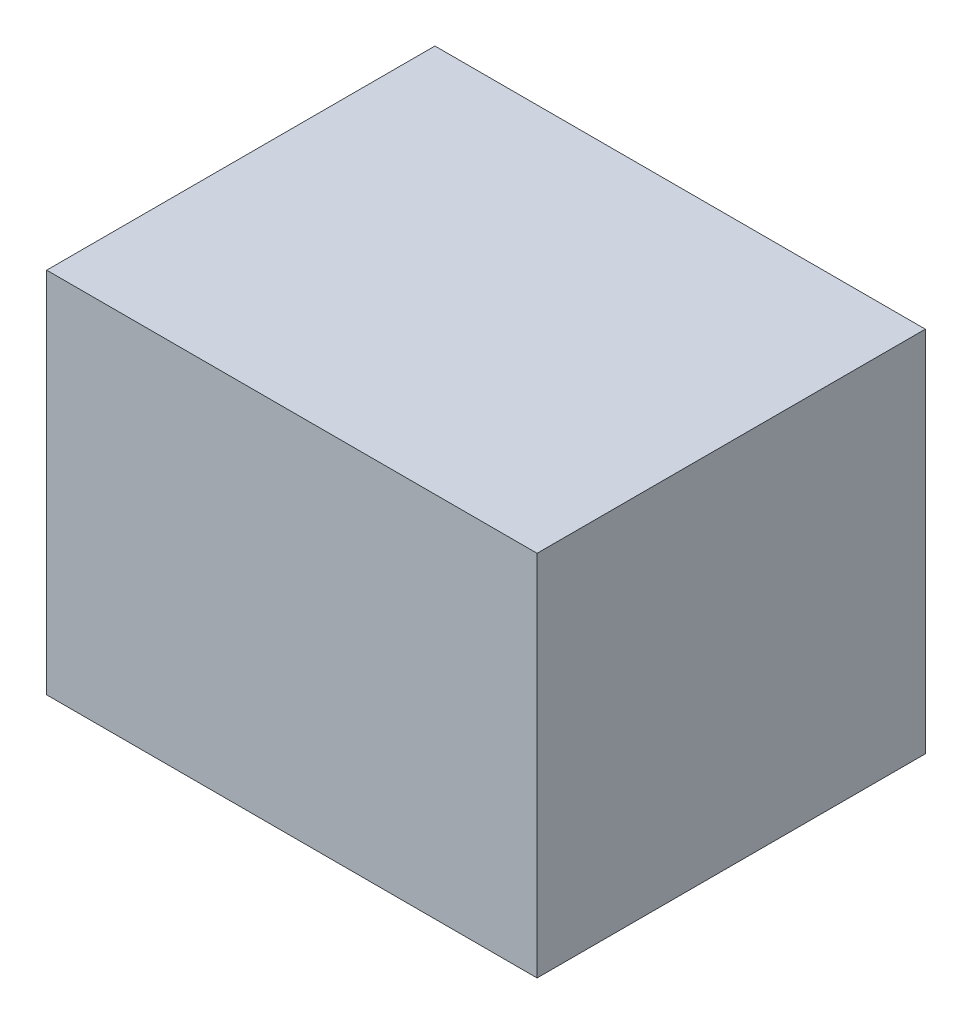
ISO-10303-21;
HEADER;
FILE_DESCRIPTION(('STEP AP214'),'2;1');
FILE_NAME('part.step','',(''),(''),'','','');
FILE_SCHEMA(('AUTOMOTIVE_DESIGN { 1 0 10303 214 1 1 1 1 }'));
ENDSEC;
DATA;
#1=APPLICATION_CONTEXT('core data for automotive mechanical design processes');
#2=APPLICATION_PROTOCOL_DEFINITION('international standard','automotive_design',2000,#1);
#3=PRODUCT_CONTEXT('',#1,'mechanical');
#4=PRODUCT('Part','Part','',(#3));
#5=PRODUCT_RELATED_PRODUCT_CATEGORY('part','',(#4));
#6=PRODUCT_DEFINITION_FORMATION('','',#4);
#7=PRODUCT_DEFINITION_CONTEXT('part definition',#1,'design');
#8=PRODUCT_DEFINITION('design','',#6,#7);
#9=PRODUCT_DEFINITION_SHAPE('','',#8);
#10=(LENGTH_UNIT() NAMED_UNIT(*) SI_UNIT(.MILLI.,.METRE.));
#11=(NAMED_UNIT(*) PLANE_ANGLE_UNIT() SI_UNIT($,.RADIAN.));
#12=(NAMED_UNIT(*) SI_UNIT($,.STERADIAN.) SOLID_ANGLE_UNIT());
#13=UNCERTAINTY_MEASURE_WITH_UNIT(LENGTH_MEASURE(1.E-05),#10,'distance_accuracy_value','');
#14=(GEOMETRIC_REPRESENTATION_CONTEXT(3) GLOBAL_UNCERTAINTY_ASSIGNED_CONTEXT((#13)) GLOBAL_UNIT_ASSIGNED_CONTEXT((#10,
#11,#12)) REPRESENTATION_CONTEXT('',''));
#15=CARTESIAN_POINT('',(0.,0.,0.));
#16=DIRECTION('',(0.,0.,1.));
#17=DIRECTION('',(1.,0.,0.));
#18=AXIS2_PLACEMENT_3D('',#15,#16,#17);
#19=CARTESIAN_POINT('',(-1.20000014,0.90000074,0.));
#20=DIRECTION('',(1.,0.,0.));
#21=DIRECTION('',(0.,-1.,0.));
#22=AXIS2_PLACEMENT_3D('',#19,#20,#21);
#23=PLANE('',#22);
#24=DIRECTION('',(0.,-1.,0.));
#25=VECTOR('',#24,1.);
#26=CARTESIAN_POINT('',(-1.20000014,0.90000074,0.));
#27=LINE('',#26,#25);
#28=CARTESIAN_POINT('',(-1.20000014,0.90000074,0.));
#29=VERTEX_POINT('',#28);
#30=CARTESIAN_POINT('',(-1.20000014,-0.8999982,0.));
#31=VERTEX_POINT('',#30);
#32=EDGE_CURVE('E11',#29,#31,#27,.T.);
#33=ORIENTED_EDGE('',*,*,#32,.T.);
#34=DIRECTION('',(0.,0.,1.));
#35=VECTOR('',#34,1.);
#36=CARTESIAN_POINT('',(-1.20000014,-0.8999982,0.));
#37=LINE('',#36,#35);
#38=CARTESIAN_POINT('',(-1.20000014,-0.8999982,1.89999874));
#39=VERTEX_POINT('',#38);
#40=EDGE_CURVE('E24',#31,#39,#37,.T.);
#41=ORIENTED_EDGE('',*,*,#40,.T.);
#42=DIRECTION('',(0.,-1.,0.));
#43=VECTOR('',#42,1.);
#44=CARTESIAN_POINT('',(-1.20000014,0.90000074,1.89999874));
#45=LINE('',#44,#43);
#46=CARTESIAN_POINT('',(-1.20000014,0.90000074,1.89999874));
#47=VERTEX_POINT('',#46);
#48=EDGE_CURVE('E87',#47,#39,#45,.T.);
#49=ORIENTED_EDGE('',*,*,#48,.F.);
#50=DIRECTION('',(0.,0.,1.));
#51=VECTOR('',#50,1.);
#52=CARTESIAN_POINT('',(-1.20000014,0.90000074,0.));
#53=LINE('',#52,#51);
#54=EDGE_CURVE('E36',#29,#47,#53,.T.);
#55=ORIENTED_EDGE('',*,*,#54,.F.);
#56=EDGE_LOOP('',(#33,#41,#49,#55));
#57=FACE_BOUND('',#56,.T.);
#58=ADVANCED_FACE('F17',(#57),#23,.F.);
#59=CARTESIAN_POINT('',(-1.20000014,-0.8999982,0.));
#60=DIRECTION('',(0.,1.,0.));
#61=DIRECTION('',(1.,0.,0.));
#62=AXIS2_PLACEMENT_3D('',#59,#60,#61);
#63=PLANE('',#62);
#64=DIRECTION('',(1.,0.,0.));
#65=VECTOR('',#64,1.);
#66=CARTESIAN_POINT('',(-1.20000014,-0.8999982,0.));
#67=LINE('',#66,#65);
#68=CARTESIAN_POINT('',(1.20000014,-0.8999982,0.));
#69=VERTEX_POINT('',#68);
#70=EDGE_CURVE('E84',#31,#69,#67,.T.);
#71=ORIENTED_EDGE('',*,*,#70,.T.);
#72=DIRECTION('',(0.,0.,1.));
#73=VECTOR('',#72,1.);
#74=CARTESIAN_POINT('',(1.20000014,-0.8999982,0.));
#75=LINE('',#74,#73);
#76=CARTESIAN_POINT('',(1.20000014,-0.8999982,1.89999874));
#77=VERTEX_POINT('',#76);
#78=EDGE_CURVE('E82',#69,#77,#75,.T.);
#79=ORIENTED_EDGE('',*,*,#78,.T.);
#80=DIRECTION('',(1.,0.,0.));
#81=VECTOR('',#80,1.);
#82=CARTESIAN_POINT('',(-1.20000014,-0.8999982,1.89999874));
#83=LINE('',#82,#81);
#84=EDGE_CURVE('E62',#39,#77,#83,.T.);
#85=ORIENTED_EDGE('',*,*,#84,.F.);
#86=ORIENTED_EDGE('',*,*,#40,.F.);
#87=EDGE_LOOP('',(#71,#79,#85,#86));
#88=FACE_BOUND('',#87,.T.);
#89=ADVANCED_FACE('F89',(#88),#63,.F.);
#90=CARTESIAN_POINT('',(1.20000014,-0.8999982,0.));
#91=DIRECTION('',(-1.,0.,0.));
#92=DIRECTION('',(0.,1.,0.));
#93=AXIS2_PLACEMENT_3D('',#90,#91,#92);
#94=PLANE('',#93);
#95=DIRECTION('',(0.,1.,0.));
#96=VECTOR('',#95,1.);
#97=CARTESIAN_POINT('',(1.20000014,-0.8999982,0.));
#98=LINE('',#97,#96);
#99=CARTESIAN_POINT('',(1.20000014,0.90000074,0.));
#100=VERTEX_POINT('',#99);
#101=EDGE_CURVE('E71',#69,#100,#98,.T.);
#102=ORIENTED_EDGE('',*,*,#101,.T.);
#103=DIRECTION('',(0.,0.,1.));
#104=VECTOR('',#103,1.);
#105=CARTESIAN_POINT('',(1.20000014,0.90000074,0.));
#106=LINE('',#105,#104);
#107=CARTESIAN_POINT('',(1.20000014,0.90000074,1.89999874));
#108=VERTEX_POINT('',#107);
#109=EDGE_CURVE('E65',#100,#108,#106,.T.);
#110=ORIENTED_EDGE('',*,*,#109,.T.);
#111=DIRECTION('',(0.,1.,0.));
#112=VECTOR('',#111,1.);
#113=CARTESIAN_POINT('',(1.20000014,-0.8999982,1.89999874));
#114=LINE('',#113,#112);
#115=EDGE_CURVE('E57',#77,#108,#114,.T.);
#116=ORIENTED_EDGE('',*,*,#115,.F.);
#117=ORIENTED_EDGE('',*,*,#78,.F.);
#118=EDGE_LOOP('',(#102,#110,#116,#117));
#119=FACE_BOUND('',#118,.T.);
#120=ADVANCED_FACE('F69',(#119),#94,.F.);
#121=CARTESIAN_POINT('',(1.20000014,0.90000074,0.));
#122=DIRECTION('',(0.,-1.,0.));
#123=DIRECTION('',(-1.,0.,0.));
#124=AXIS2_PLACEMENT_3D('',#121,#122,#123);
#125=PLANE('',#124);
#126=DIRECTION('',(-1.,0.,0.));
#127=VECTOR('',#126,1.);
#128=CARTESIAN_POINT('',(1.20000014,0.90000074,0.));
#129=LINE('',#128,#127);
#130=EDGE_CURVE('E66',#100,#29,#129,.T.);
#131=ORIENTED_EDGE('',*,*,#130,.T.);
#132=ORIENTED_EDGE('',*,*,#54,.T.);
#133=DIRECTION('',(-1.,0.,0.));
#134=VECTOR('',#133,1.);
#135=CARTESIAN_POINT('',(1.20000014,0.90000074,1.89999874));
#136=LINE('',#135,#134);
#137=EDGE_CURVE('E61',#108,#47,#136,.T.);
#138=ORIENTED_EDGE('',*,*,#137,.F.);
#139=ORIENTED_EDGE('',*,*,#109,.F.);
#140=EDGE_LOOP('',(#131,#132,#138,#139));
#141=FACE_BOUND('',#140,.T.);
#142=ADVANCED_FACE('F76',(#141),#125,.F.);
#143=CARTESIAN_POINT('',(-1.20000014,0.90000074,0.));
#144=DIRECTION('',(0.,0.,-1.));
#145=DIRECTION('',(-1.,0.,0.));
#146=AXIS2_PLACEMENT_3D('',#143,#144,#145);
#147=PLANE('',#146);
#148=ORIENTED_EDGE('',*,*,#130,.F.);
#149=ORIENTED_EDGE('',*,*,#101,.F.);
#150=ORIENTED_EDGE('',*,*,#70,.F.);
#151=ORIENTED_EDGE('',*,*,#32,.F.);
#152=EDGE_LOOP('',(#148,#149,#150,#151));
#153=FACE_BOUND('',#152,.T.);
#154=ADVANCED_FACE('F91',(#153),#147,.T.);
#155=CARTESIAN_POINT('',(-1.20000014,0.90000074,1.89999874));
#156=DIRECTION('',(0.,0.,-1.));
#157=DIRECTION('',(-1.,0.,0.));
#158=AXIS2_PLACEMENT_3D('',#155,#156,#157);
#159=PLANE('',#158);
#160=ORIENTED_EDGE('',*,*,#48,.T.);
#161=ORIENTED_EDGE('',*,*,#84,.T.);
#162=ORIENTED_EDGE('',*,*,#115,.T.);
#163=ORIENTED_EDGE('',*,*,#137,.T.);
#164=EDGE_LOOP('',(#160,#161,#162,#163));
#165=FACE_BOUND('',#164,.T.);
#166=ADVANCED_FACE('F59',(#165),#159,.F.);
#167=CLOSED_SHELL('',(#58,#89,#120,#142,#154,#166));
#168=MANIFOLD_SOLID_BREP('B1',#167);
#169=ADVANCED_BREP_SHAPE_REPRESENTATION('',(#18,#168),#14);
#170=SHAPE_DEFINITION_REPRESENTATION(#9,#169);
ENDSEC;
END-ISO-10303-21;
